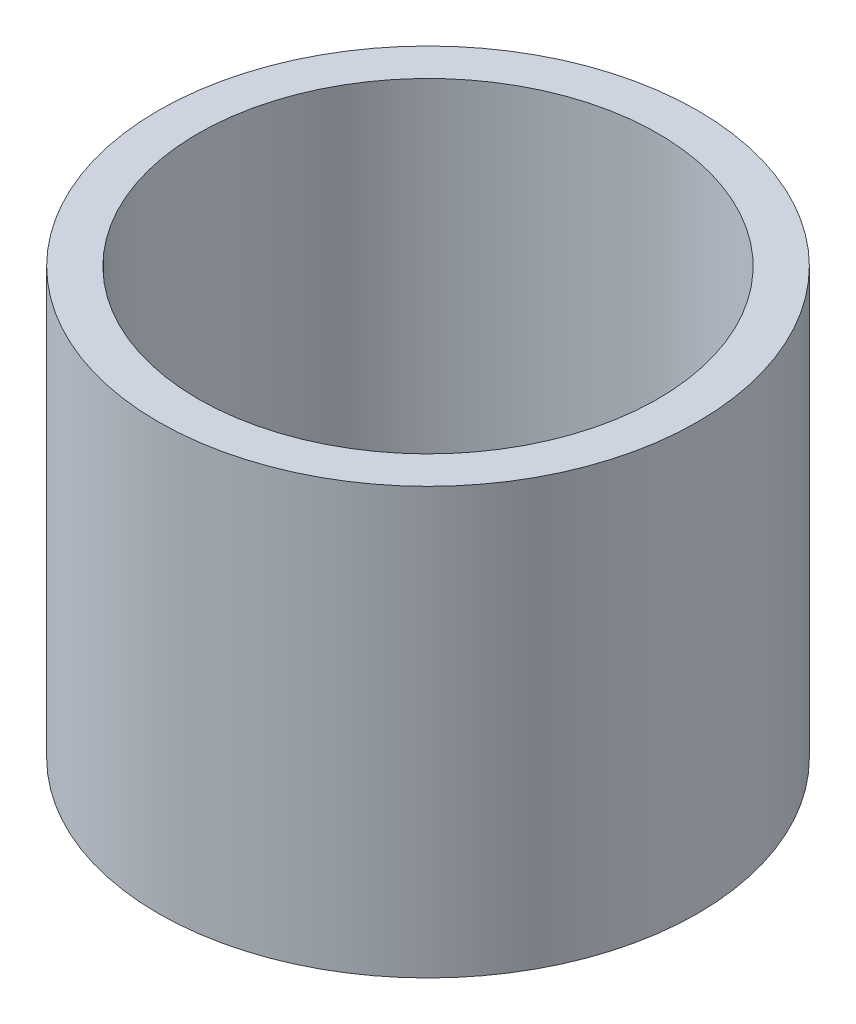
ISO-10303-21;
HEADER;
FILE_DESCRIPTION(('STEP AP214'),'2;1');
FILE_NAME('part.step','',(''),(''),'','','');
FILE_SCHEMA(('AUTOMOTIVE_DESIGN { 1 0 10303 214 1 1 1 1 }'));
ENDSEC;
DATA;
#1=APPLICATION_CONTEXT('core data for automotive mechanical design processes');
#2=APPLICATION_PROTOCOL_DEFINITION('international standard','automotive_design',2000,#1);
#3=PRODUCT_CONTEXT('',#1,'mechanical');
#4=PRODUCT('Part','Part','',(#3));
#5=PRODUCT_RELATED_PRODUCT_CATEGORY('part','',(#4));
#6=PRODUCT_DEFINITION_FORMATION('','',#4);
#7=PRODUCT_DEFINITION_CONTEXT('part definition',#1,'design');
#8=PRODUCT_DEFINITION('design','',#6,#7);
#9=PRODUCT_DEFINITION_SHAPE('','',#8);
#10=(LENGTH_UNIT() NAMED_UNIT(*) SI_UNIT(.MILLI.,.METRE.));
#11=(NAMED_UNIT(*) PLANE_ANGLE_UNIT() SI_UNIT($,.RADIAN.));
#12=(NAMED_UNIT(*) SI_UNIT($,.STERADIAN.) SOLID_ANGLE_UNIT());
#13=UNCERTAINTY_MEASURE_WITH_UNIT(LENGTH_MEASURE(1.E-05),#10,'distance_accuracy_value','');
#14=(GEOMETRIC_REPRESENTATION_CONTEXT(3) GLOBAL_UNCERTAINTY_ASSIGNED_CONTEXT((#13)) GLOBAL_UNIT_ASSIGNED_CONTEXT((#10,
#11,#12)) REPRESENTATION_CONTEXT('',''));
#15=CARTESIAN_POINT('',(0.,0.,0.));
#16=DIRECTION('',(0.,0.,1.));
#17=DIRECTION('',(1.,0.,0.));
#18=AXIS2_PLACEMENT_3D('',#15,#16,#17);
#19=CARTESIAN_POINT('',(0.,15.,0.));
#20=DIRECTION('',(0.,1.,0.));
#21=DIRECTION('',(0.,0.,1.));
#22=AXIS2_PLACEMENT_3D('',#19,#20,#21);
#23=PLANE('',#22);
#24=CARTESIAN_POINT('',(0.,15.,0.));
#25=DIRECTION('',(0.,1.,0.));
#26=DIRECTION('',(0.,0.,1.));
#27=AXIS2_PLACEMENT_3D('',#24,#25,#26);
#28=CIRCLE('',#27,9.5);
#29=CARTESIAN_POINT('',(0.,15.,9.5));
#30=VERTEX_POINT('',#29);
#31=EDGE_CURVE('E10',#30,#30,#28,.T.);
#32=ORIENTED_EDGE('',*,*,#31,.T.);
#33=EDGE_LOOP('',(#32));
#34=FACE_BOUND('',#33,.T.);
#35=CARTESIAN_POINT('',(0.,15.,0.));
#36=DIRECTION('',(0.,1.,0.));
#37=DIRECTION('',(0.,0.,1.));
#38=AXIS2_PLACEMENT_3D('',#35,#36,#37);
#39=CIRCLE('',#38,8.1);
#40=CARTESIAN_POINT('',(0.,15.,8.1));
#41=VERTEX_POINT('',#40);
#42=EDGE_CURVE('E44',#41,#41,#39,.T.);
#43=ORIENTED_EDGE('',*,*,#42,.F.);
#44=EDGE_LOOP('',(#43));
#45=FACE_BOUND('',#44,.T.);
#46=ADVANCED_FACE('F33',(#34,#45),#23,.T.);
#47=CARTESIAN_POINT('',(0.,0.,0.));
#48=DIRECTION('',(0.,1.,0.));
#49=DIRECTION('',(0.,0.,1.));
#50=AXIS2_PLACEMENT_3D('',#47,#48,#49);
#51=PLANE('',#50);
#52=CARTESIAN_POINT('',(0.,0.,0.));
#53=DIRECTION('',(0.,1.,0.));
#54=DIRECTION('',(0.,0.,1.));
#55=AXIS2_PLACEMENT_3D('',#52,#53,#54);
#56=CIRCLE('',#55,9.5);
#57=CARTESIAN_POINT('',(0.,0.,9.5));
#58=VERTEX_POINT('',#57);
#59=EDGE_CURVE('E37',#58,#58,#56,.T.);
#60=ORIENTED_EDGE('',*,*,#59,.F.);
#61=EDGE_LOOP('',(#60));
#62=FACE_BOUND('',#61,.T.);
#63=CARTESIAN_POINT('',(0.,0.,0.));
#64=DIRECTION('',(0.,1.,0.));
#65=DIRECTION('',(0.,0.,1.));
#66=AXIS2_PLACEMENT_3D('',#63,#64,#65);
#67=CIRCLE('',#66,8.1);
#68=CARTESIAN_POINT('',(0.,0.,8.1));
#69=VERTEX_POINT('',#68);
#70=EDGE_CURVE('E46',#69,#69,#67,.T.);
#71=ORIENTED_EDGE('',*,*,#70,.T.);
#72=EDGE_LOOP('',(#71));
#73=FACE_BOUND('',#72,.T.);
#74=ADVANCED_FACE('F56',(#62,#73),#51,.F.);
#75=CARTESIAN_POINT('',(0.,15.,0.));
#76=DIRECTION('',(0.,-1.,0.));
#77=DIRECTION('',(0.,0.,-1.));
#78=AXIS2_PLACEMENT_3D('',#75,#76,#77);
#79=CYLINDRICAL_SURFACE('',#78,9.5);
#80=ORIENTED_EDGE('',*,*,#31,.F.);
#81=EDGE_LOOP('',(#80));
#82=FACE_BOUND('',#81,.T.);
#83=ORIENTED_EDGE('',*,*,#59,.T.);
#84=EDGE_LOOP('',(#83));
#85=FACE_BOUND('',#84,.T.);
#86=ADVANCED_FACE('F35',(#82,#85),#79,.T.);
#87=CARTESIAN_POINT('',(0.,15.,0.));
#88=DIRECTION('',(0.,-1.,0.));
#89=DIRECTION('',(0.,0.,-1.));
#90=AXIS2_PLACEMENT_3D('',#87,#88,#89);
#91=CYLINDRICAL_SURFACE('',#90,8.1);
#92=ORIENTED_EDGE('',*,*,#42,.T.);
#93=EDGE_LOOP('',(#92));
#94=FACE_BOUND('',#93,.T.);
#95=ORIENTED_EDGE('',*,*,#70,.F.);
#96=EDGE_LOOP('',(#95));
#97=FACE_BOUND('',#96,.T.);
#98=ADVANCED_FACE('F52',(#94,#97),#91,.F.);
#99=CLOSED_SHELL('',(#46,#74,#86,#98));
#100=MANIFOLD_SOLID_BREP('B2',#99);
#101=ADVANCED_BREP_SHAPE_REPRESENTATION('',(#18,#100),#14);
#102=SHAPE_DEFINITION_REPRESENTATION(#9,#101);
ENDSEC;
END-ISO-10303-21;
